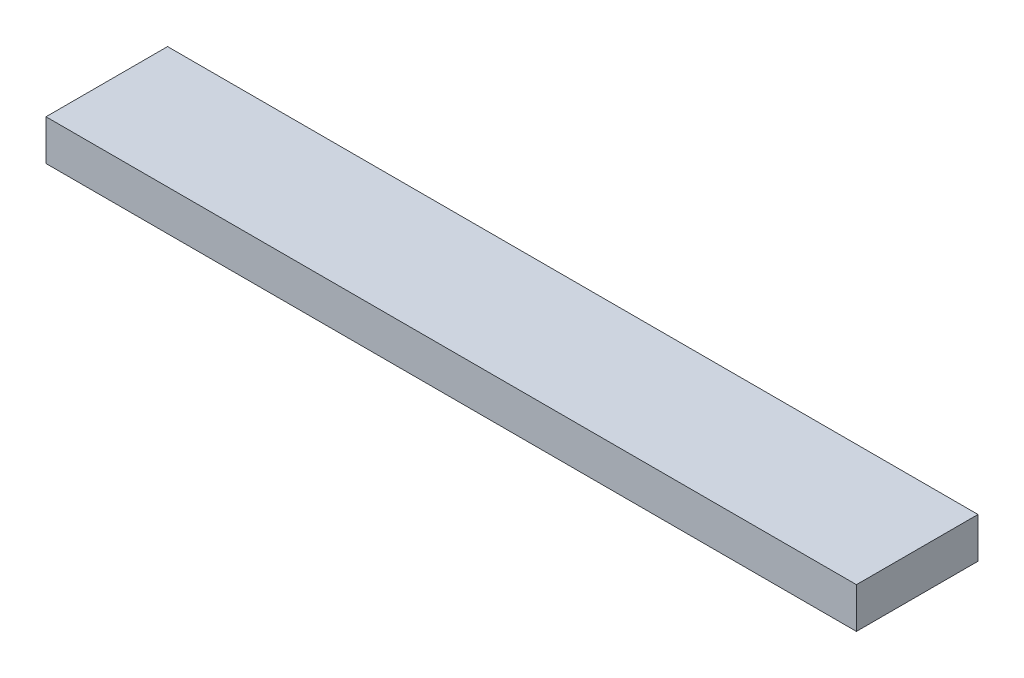
ISO-10303-21;
HEADER;
FILE_DESCRIPTION(('STEP AP214'),'2;1');
FILE_NAME('part.step','',(''),(''),'','','');
FILE_SCHEMA(('AUTOMOTIVE_DESIGN { 1 0 10303 214 1 1 1 1 }'));
ENDSEC;
DATA;
#1=APPLICATION_CONTEXT('core data for automotive mechanical design processes');
#2=APPLICATION_PROTOCOL_DEFINITION('international standard','automotive_design',2000,#1);
#3=PRODUCT_CONTEXT('',#1,'mechanical');
#4=PRODUCT('Part','Part','',(#3));
#5=PRODUCT_RELATED_PRODUCT_CATEGORY('part','',(#4));
#6=PRODUCT_DEFINITION_FORMATION('','',#4);
#7=PRODUCT_DEFINITION_CONTEXT('part definition',#1,'design');
#8=PRODUCT_DEFINITION('design','',#6,#7);
#9=PRODUCT_DEFINITION_SHAPE('','',#8);
#10=(LENGTH_UNIT() NAMED_UNIT(*) SI_UNIT(.MILLI.,.METRE.));
#11=(NAMED_UNIT(*) PLANE_ANGLE_UNIT() SI_UNIT($,.RADIAN.));
#12=(NAMED_UNIT(*) SI_UNIT($,.STERADIAN.) SOLID_ANGLE_UNIT());
#13=UNCERTAINTY_MEASURE_WITH_UNIT(LENGTH_MEASURE(1.E-05),#10,'distance_accuracy_value','');
#14=(GEOMETRIC_REPRESENTATION_CONTEXT(3) GLOBAL_UNCERTAINTY_ASSIGNED_CONTEXT((#13)) GLOBAL_UNIT_ASSIGNED_CONTEXT((#10,
#11,#12)) REPRESENTATION_CONTEXT('',''));
#15=CARTESIAN_POINT('',(0.,0.,0.));
#16=DIRECTION('',(0.,0.,1.));
#17=DIRECTION('',(1.,0.,0.));
#18=AXIS2_PLACEMENT_3D('',#15,#16,#17);
#19=CARTESIAN_POINT('',(0.,10.,0.));
#20=DIRECTION('',(1.,0.,0.));
#21=DIRECTION('',(0.,0.,-1.));
#22=AXIS2_PLACEMENT_3D('',#19,#20,#21);
#23=PLANE('',#22);
#24=DIRECTION('',(0.,0.,1.));
#25=VECTOR('',#24,1.);
#26=CARTESIAN_POINT('',(0.,0.,0.));
#27=LINE('',#26,#25);
#28=CARTESIAN_POINT('',(0.,0.,-30.));
#29=VERTEX_POINT('',#28);
#30=CARTESIAN_POINT('',(0.,0.,0.));
#31=VERTEX_POINT('',#30);
#32=EDGE_CURVE('E101',#29,#31,#27,.T.);
#33=ORIENTED_EDGE('',*,*,#32,.T.);
#34=DIRECTION('',(0.,-1.,0.));
#35=VECTOR('',#34,1.);
#36=CARTESIAN_POINT('',(0.,10.,0.));
#37=LINE('',#36,#35);
#38=CARTESIAN_POINT('',(0.,10.,0.));
#39=VERTEX_POINT('',#38);
#40=EDGE_CURVE('E11',#39,#31,#37,.T.);
#41=ORIENTED_EDGE('',*,*,#40,.F.);
#42=DIRECTION('',(0.,0.,1.));
#43=VECTOR('',#42,1.);
#44=CARTESIAN_POINT('',(0.,10.,0.));
#45=LINE('',#44,#43);
#46=CARTESIAN_POINT('',(0.,10.,-30.));
#47=VERTEX_POINT('',#46);
#48=EDGE_CURVE('E89',#47,#39,#45,.T.);
#49=ORIENTED_EDGE('',*,*,#48,.F.);
#50=DIRECTION('',(0.,-1.,0.));
#51=VECTOR('',#50,1.);
#52=CARTESIAN_POINT('',(0.,10.,-30.));
#53=LINE('',#52,#51);
#54=EDGE_CURVE('E97',#47,#29,#53,.T.);
#55=ORIENTED_EDGE('',*,*,#54,.T.);
#56=EDGE_LOOP('',(#33,#41,#49,#55));
#57=FACE_BOUND('',#56,.T.);
#58=ADVANCED_FACE('F38',(#57),#23,.F.);
#59=CARTESIAN_POINT('',(0.,10.,0.));
#60=DIRECTION('',(0.,0.,-1.));
#61=DIRECTION('',(-1.,0.,0.));
#62=AXIS2_PLACEMENT_3D('',#59,#60,#61);
#63=PLANE('',#62);
#64=DIRECTION('',(1.,0.,0.));
#65=VECTOR('',#64,1.);
#66=CARTESIAN_POINT('',(0.,0.,0.));
#67=LINE('',#66,#65);
#68=CARTESIAN_POINT('',(200.,0.,0.));
#69=VERTEX_POINT('',#68);
#70=EDGE_CURVE('E93',#31,#69,#67,.T.);
#71=ORIENTED_EDGE('',*,*,#70,.T.);
#72=DIRECTION('',(0.,-1.,0.));
#73=VECTOR('',#72,1.);
#74=CARTESIAN_POINT('',(200.,10.,0.));
#75=LINE('',#74,#73);
#76=CARTESIAN_POINT('',(200.,10.,0.));
#77=VERTEX_POINT('',#76);
#78=EDGE_CURVE('E46',#77,#69,#75,.T.);
#79=ORIENTED_EDGE('',*,*,#78,.F.);
#80=DIRECTION('',(1.,0.,0.));
#81=VECTOR('',#80,1.);
#82=CARTESIAN_POINT('',(0.,10.,0.));
#83=LINE('',#82,#81);
#84=EDGE_CURVE('E84',#39,#77,#83,.T.);
#85=ORIENTED_EDGE('',*,*,#84,.F.);
#86=ORIENTED_EDGE('',*,*,#40,.T.);
#87=EDGE_LOOP('',(#71,#79,#85,#86));
#88=FACE_BOUND('',#87,.T.);
#89=ADVANCED_FACE('F92',(#88),#63,.F.);
#90=CARTESIAN_POINT('',(200.,10.,0.));
#91=DIRECTION('',(-1.,0.,0.));
#92=DIRECTION('',(0.,0.,1.));
#93=AXIS2_PLACEMENT_3D('',#90,#91,#92);
#94=PLANE('',#93);
#95=DIRECTION('',(0.,0.,-1.));
#96=VECTOR('',#95,1.);
#97=CARTESIAN_POINT('',(200.,0.,0.));
#98=LINE('',#97,#96);
#99=CARTESIAN_POINT('',(200.,0.,-30.));
#100=VERTEX_POINT('',#99);
#101=EDGE_CURVE('E71',#69,#100,#98,.T.);
#102=ORIENTED_EDGE('',*,*,#101,.T.);
#103=DIRECTION('',(0.,-1.,0.));
#104=VECTOR('',#103,1.);
#105=CARTESIAN_POINT('',(200.,10.,-30.));
#106=LINE('',#105,#104);
#107=CARTESIAN_POINT('',(200.,10.,-30.));
#108=VERTEX_POINT('',#107);
#109=EDGE_CURVE('E94',#108,#100,#106,.T.);
#110=ORIENTED_EDGE('',*,*,#109,.F.);
#111=DIRECTION('',(0.,0.,-1.));
#112=VECTOR('',#111,1.);
#113=CARTESIAN_POINT('',(200.,10.,0.));
#114=LINE('',#113,#112);
#115=EDGE_CURVE('E87',#77,#108,#114,.T.);
#116=ORIENTED_EDGE('',*,*,#115,.F.);
#117=ORIENTED_EDGE('',*,*,#78,.T.);
#118=EDGE_LOOP('',(#102,#110,#116,#117));
#119=FACE_BOUND('',#118,.T.);
#120=ADVANCED_FACE('F95',(#119),#94,.F.);
#121=CARTESIAN_POINT('',(0.,10.,-30.));
#122=DIRECTION('',(0.,0.,1.));
#123=DIRECTION('',(1.,0.,0.));
#124=AXIS2_PLACEMENT_3D('',#121,#122,#123);
#125=PLANE('',#124);
#126=DIRECTION('',(-1.,0.,0.));
#127=VECTOR('',#126,1.);
#128=CARTESIAN_POINT('',(0.,0.,-30.));
#129=LINE('',#128,#127);
#130=EDGE_CURVE('E77',#100,#29,#129,.T.);
#131=ORIENTED_EDGE('',*,*,#130,.T.);
#132=ORIENTED_EDGE('',*,*,#54,.F.);
#133=DIRECTION('',(-1.,0.,0.));
#134=VECTOR('',#133,1.);
#135=CARTESIAN_POINT('',(0.,10.,-30.));
#136=LINE('',#135,#134);
#137=EDGE_CURVE('E54',#108,#47,#136,.T.);
#138=ORIENTED_EDGE('',*,*,#137,.F.);
#139=ORIENTED_EDGE('',*,*,#109,.T.);
#140=EDGE_LOOP('',(#131,#132,#138,#139));
#141=FACE_BOUND('',#140,.T.);
#142=ADVANCED_FACE('F108',(#141),#125,.F.);
#143=CARTESIAN_POINT('',(0.,10.,0.));
#144=DIRECTION('',(0.,-1.,0.));
#145=DIRECTION('',(0.,0.,-1.));
#146=AXIS2_PLACEMENT_3D('',#143,#144,#145);
#147=PLANE('',#146);
#148=ORIENTED_EDGE('',*,*,#48,.T.);
#149=ORIENTED_EDGE('',*,*,#84,.T.);
#150=ORIENTED_EDGE('',*,*,#115,.T.);
#151=ORIENTED_EDGE('',*,*,#137,.T.);
#152=EDGE_LOOP('',(#148,#149,#150,#151));
#153=FACE_BOUND('',#152,.T.);
#154=ADVANCED_FACE('F85',(#153),#147,.F.);
#155=CARTESIAN_POINT('',(0.,0.,0.));
#156=DIRECTION('',(0.,-1.,0.));
#157=DIRECTION('',(0.,0.,-1.));
#158=AXIS2_PLACEMENT_3D('',#155,#156,#157);
#159=PLANE('',#158);
#160=ORIENTED_EDGE('',*,*,#32,.F.);
#161=ORIENTED_EDGE('',*,*,#130,.F.);
#162=ORIENTED_EDGE('',*,*,#101,.F.);
#163=ORIENTED_EDGE('',*,*,#70,.F.);
#164=EDGE_LOOP('',(#160,#161,#162,#163));
#165=FACE_BOUND('',#164,.T.);
#166=ADVANCED_FACE('F111',(#165),#159,.T.);
#167=CLOSED_SHELL('',(#58,#89,#120,#142,#154,#166));
#168=MANIFOLD_SOLID_BREP('B2',#167);
#169=ADVANCED_BREP_SHAPE_REPRESENTATION('',(#18,#168),#14);
#170=SHAPE_DEFINITION_REPRESENTATION(#9,#169);
ENDSEC;
END-ISO-10303-21;
